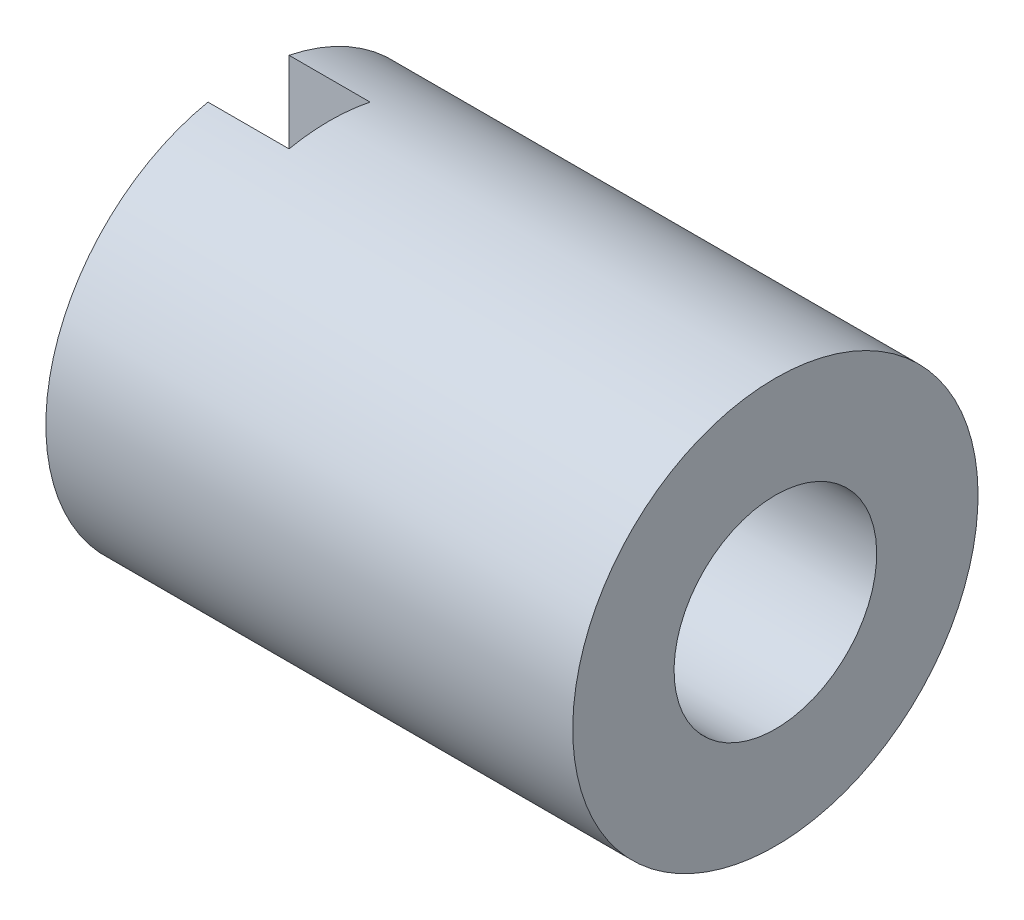
ISO-10303-21;
HEADER;
FILE_DESCRIPTION(('STEP AP214'),'2;1');
FILE_NAME('part.step','',(''),(''),'','','');
FILE_SCHEMA(('AUTOMOTIVE_DESIGN { 1 0 10303 214 1 1 1 1 }'));
ENDSEC;
DATA;
#1=APPLICATION_CONTEXT('core data for automotive mechanical design processes');
#2=APPLICATION_PROTOCOL_DEFINITION('international standard','automotive_design',2000,#1);
#3=PRODUCT_CONTEXT('',#1,'mechanical');
#4=PRODUCT('Part','Part','',(#3));
#5=PRODUCT_RELATED_PRODUCT_CATEGORY('part','',(#4));
#6=PRODUCT_DEFINITION_FORMATION('','',#4);
#7=PRODUCT_DEFINITION_CONTEXT('part definition',#1,'design');
#8=PRODUCT_DEFINITION('design','',#6,#7);
#9=PRODUCT_DEFINITION_SHAPE('','',#8);
#10=(LENGTH_UNIT() NAMED_UNIT(*) SI_UNIT(.MILLI.,.METRE.));
#11=(NAMED_UNIT(*) PLANE_ANGLE_UNIT() SI_UNIT($,.RADIAN.));
#12=(NAMED_UNIT(*) SI_UNIT($,.STERADIAN.) SOLID_ANGLE_UNIT());
#13=UNCERTAINTY_MEASURE_WITH_UNIT(LENGTH_MEASURE(1.E-05),#10,'distance_accuracy_value','');
#14=(GEOMETRIC_REPRESENTATION_CONTEXT(3) GLOBAL_UNCERTAINTY_ASSIGNED_CONTEXT((#13)) GLOBAL_UNIT_ASSIGNED_CONTEXT((#10,
#11,#12)) REPRESENTATION_CONTEXT('',''));
#15=CARTESIAN_POINT('',(0.,0.,0.));
#16=DIRECTION('',(0.,0.,1.));
#17=DIRECTION('',(1.,0.,0.));
#18=AXIS2_PLACEMENT_3D('',#15,#16,#17);
#19=CARTESIAN_POINT('',(0.,0.,0.));
#20=DIRECTION('',(-1.,0.,0.));
#21=DIRECTION('',(0.,-1.,0.));
#22=AXIS2_PLACEMENT_3D('',#19,#20,#21);
#23=PLANE('',#22);
#24=DIRECTION('',(0.,1.,0.));
#25=VECTOR('',#24,1.);
#26=CARTESIAN_POINT('',(0.,-2.5,0.5));
#27=LINE('',#26,#25);
#28=CARTESIAN_POINT('',(0.,-2.44948974278318,0.5));
#29=VERTEX_POINT('',#28);
#30=CARTESIAN_POINT('',(0.,2.44948974278318,0.5));
#31=VERTEX_POINT('',#30);
#32=EDGE_CURVE('E77',#29,#31,#27,.T.);
#33=ORIENTED_EDGE('',*,*,#32,.F.);
#34=CARTESIAN_POINT('',(0.,0.,0.));
#35=DIRECTION('',(1.,0.,0.));
#36=DIRECTION('',(0.,1.,0.));
#37=AXIS2_PLACEMENT_3D('',#34,#35,#36);
#38=CIRCLE('',#37,2.5);
#39=EDGE_CURVE('E82',#31,#29,#38,.T.);
#40=ORIENTED_EDGE('',*,*,#39,.F.);
#41=EDGE_LOOP('',(#33,#40));
#42=FACE_BOUND('',#41,.T.);
#43=ADVANCED_FACE('F36',(#42),#23,.T.);
#44=DIRECTION('',(0.,-1.,0.));
#45=VECTOR('',#44,1.);
#46=CARTESIAN_POINT('',(0.,-2.5,-0.5));
#47=LINE('',#46,#45);
#48=CARTESIAN_POINT('',(0.,2.44948974278318,-0.5));
#49=VERTEX_POINT('',#48);
#50=CARTESIAN_POINT('',(0.,-2.44948974278318,-0.5));
#51=VERTEX_POINT('',#50);
#52=EDGE_CURVE('E83',#49,#51,#47,.T.);
#53=ORIENTED_EDGE('',*,*,#52,.F.);
#54=EDGE_CURVE('E90',#51,#49,#38,.T.);
#55=ORIENTED_EDGE('',*,*,#54,.F.);
#56=EDGE_LOOP('',(#53,#55));
#57=FACE_BOUND('',#56,.T.);
#58=ADVANCED_FACE('F38',(#57),#23,.T.);
#59=CARTESIAN_POINT('',(2.,0.,0.));
#60=DIRECTION('',(1.,0.,0.));
#61=DIRECTION('',(0.,1.,0.));
#62=AXIS2_PLACEMENT_3D('',#59,#60,#61);
#63=CYLINDRICAL_SURFACE('',#62,2.5);
#64=DIRECTION('',(1.,0.,0.));
#65=VECTOR('',#64,1.);
#66=CARTESIAN_POINT('',(2.,-2.44948974278318,0.5));
#67=LINE('',#66,#65);
#68=CARTESIAN_POINT('',(1.,-2.44948974278318,0.5));
#69=VERTEX_POINT('',#68);
#70=EDGE_CURVE('E11',#69,#29,#67,.F.);
#71=ORIENTED_EDGE('',*,*,#70,.F.);
#72=CARTESIAN_POINT('',(1.,0.,0.));
#73=DIRECTION('',(1.,0.,0.));
#74=DIRECTION('',(0.,1.,0.));
#75=AXIS2_PLACEMENT_3D('',#72,#73,#74);
#76=CIRCLE('',#75,2.5);
#77=CARTESIAN_POINT('',(1.,-2.44948974278318,-0.5));
#78=VERTEX_POINT('',#77);
#79=EDGE_CURVE('E58',#78,#69,#76,.F.);
#80=ORIENTED_EDGE('',*,*,#79,.F.);
#81=DIRECTION('',(1.,0.,0.));
#82=VECTOR('',#81,1.);
#83=CARTESIAN_POINT('',(2.,-2.44948974278318,-0.5));
#84=LINE('',#83,#82);
#85=EDGE_CURVE('E44',#51,#78,#84,.T.);
#86=ORIENTED_EDGE('',*,*,#85,.F.);
#87=ORIENTED_EDGE('',*,*,#54,.T.);
#88=DIRECTION('',(1.,0.,0.));
#89=VECTOR('',#88,1.);
#90=CARTESIAN_POINT('',(2.,2.44948974278318,-0.5));
#91=LINE('',#90,#89);
#92=CARTESIAN_POINT('',(1.,2.44948974278318,-0.5));
#93=VERTEX_POINT('',#92);
#94=EDGE_CURVE('E92',#93,#49,#91,.F.);
#95=ORIENTED_EDGE('',*,*,#94,.F.);
#96=CARTESIAN_POINT('',(1.,2.44948974278318,0.5));
#97=VERTEX_POINT('',#96);
#98=EDGE_CURVE('E89',#97,#93,#76,.F.);
#99=ORIENTED_EDGE('',*,*,#98,.F.);
#100=DIRECTION('',(1.,0.,0.));
#101=VECTOR('',#100,1.);
#102=CARTESIAN_POINT('',(2.,2.44948974278318,0.5));
#103=LINE('',#102,#101);
#104=EDGE_CURVE('E88',#31,#97,#103,.T.);
#105=ORIENTED_EDGE('',*,*,#104,.F.);
#106=ORIENTED_EDGE('',*,*,#39,.T.);
#107=EDGE_LOOP('',(#71,#80,#86,#87,#95,#99,#105,#106));
#108=FACE_BOUND('',#107,.T.);
#109=CARTESIAN_POINT('',(6.5,0.,0.));
#110=DIRECTION('',(1.,0.,0.));
#111=DIRECTION('',(0.,1.,0.));
#112=AXIS2_PLACEMENT_3D('',#109,#110,#111);
#113=CIRCLE('',#112,2.5);
#114=CARTESIAN_POINT('',(6.5,2.5,0.));
#115=VERTEX_POINT('',#114);
#116=EDGE_CURVE('E95',#115,#115,#113,.T.);
#117=ORIENTED_EDGE('',*,*,#116,.F.);
#118=EDGE_LOOP('',(#117));
#119=FACE_BOUND('',#118,.T.);
#120=ADVANCED_FACE('F85',(#108,#119),#63,.T.);
#121=CARTESIAN_POINT('',(6.5,2.5,0.));
#122=DIRECTION('',(1.,0.,0.));
#123=DIRECTION('',(0.,1.,0.));
#124=AXIS2_PLACEMENT_3D('',#121,#122,#123);
#125=PLANE('',#124);
#126=ORIENTED_EDGE('',*,*,#116,.T.);
#127=EDGE_LOOP('',(#126));
#128=FACE_BOUND('',#127,.T.);
#129=CARTESIAN_POINT('',(6.5,0.,0.));
#130=DIRECTION('',(1.,0.,0.));
#131=DIRECTION('',(0.,1.,0.));
#132=AXIS2_PLACEMENT_3D('',#129,#130,#131);
#133=CIRCLE('',#132,1.25);
#134=CARTESIAN_POINT('',(6.5,1.25,0.));
#135=VERTEX_POINT('',#134);
#136=EDGE_CURVE('E109',#135,#135,#133,.T.);
#137=ORIENTED_EDGE('',*,*,#136,.F.);
#138=EDGE_LOOP('',(#137));
#139=FACE_BOUND('',#138,.T.);
#140=ADVANCED_FACE('F119',(#128,#139),#125,.T.);
#141=CARTESIAN_POINT('',(2.,0.,0.));
#142=DIRECTION('',(1.,0.,0.));
#143=DIRECTION('',(0.,1.,0.));
#144=AXIS2_PLACEMENT_3D('',#141,#142,#143);
#145=CYLINDRICAL_SURFACE('',#144,1.25);
#146=ORIENTED_EDGE('',*,*,#136,.T.);
#147=EDGE_LOOP('',(#146));
#148=FACE_BOUND('',#147,.T.);
#149=CARTESIAN_POINT('',(2.,0.,0.));
#150=DIRECTION('',(1.,0.,0.));
#151=DIRECTION('',(0.,1.,0.));
#152=AXIS2_PLACEMENT_3D('',#149,#150,#151);
#153=CIRCLE('',#152,1.25);
#154=CARTESIAN_POINT('',(2.,1.25,0.));
#155=VERTEX_POINT('',#154);
#156=EDGE_CURVE('E106',#155,#155,#153,.T.);
#157=ORIENTED_EDGE('',*,*,#156,.F.);
#158=EDGE_LOOP('',(#157));
#159=FACE_BOUND('',#158,.T.);
#160=ADVANCED_FACE('F126',(#148,#159),#145,.F.);
#161=CARTESIAN_POINT('',(2.,1.25,0.));
#162=DIRECTION('',(1.,0.,0.));
#163=DIRECTION('',(0.,1.,0.));
#164=AXIS2_PLACEMENT_3D('',#161,#162,#163);
#165=PLANE('',#164);
#166=ORIENTED_EDGE('',*,*,#156,.T.);
#167=EDGE_LOOP('',(#166));
#168=FACE_BOUND('',#167,.T.);
#169=ADVANCED_FACE('F152',(#168),#165,.T.);
#170=CARTESIAN_POINT('',(1.,-2.5,0.5));
#171=DIRECTION('',(0.,0.,1.));
#172=DIRECTION('',(1.,0.,0.));
#173=AXIS2_PLACEMENT_3D('',#170,#171,#172);
#174=PLANE('',#173);
#175=ORIENTED_EDGE('',*,*,#70,.T.);
#176=ORIENTED_EDGE('',*,*,#32,.T.);
#177=ORIENTED_EDGE('',*,*,#104,.T.);
#178=DIRECTION('',(0.,1.,0.));
#179=VECTOR('',#178,1.);
#180=CARTESIAN_POINT('',(1.,-2.5,0.5));
#181=LINE('',#180,#179);
#182=EDGE_CURVE('E51',#69,#97,#181,.T.);
#183=ORIENTED_EDGE('',*,*,#182,.F.);
#184=EDGE_LOOP('',(#175,#176,#177,#183));
#185=FACE_BOUND('',#184,.T.);
#186=ADVANCED_FACE('F76',(#185),#174,.F.);
#187=CARTESIAN_POINT('',(1.,-2.5,-0.5));
#188=DIRECTION('',(0.,0.,-1.));
#189=DIRECTION('',(-1.,0.,0.));
#190=AXIS2_PLACEMENT_3D('',#187,#188,#189);
#191=PLANE('',#190);
#192=ORIENTED_EDGE('',*,*,#94,.T.);
#193=ORIENTED_EDGE('',*,*,#52,.T.);
#194=ORIENTED_EDGE('',*,*,#85,.T.);
#195=DIRECTION('',(0.,-1.,0.));
#196=VECTOR('',#195,1.);
#197=CARTESIAN_POINT('',(1.,-2.5,-0.5));
#198=LINE('',#197,#196);
#199=EDGE_CURVE('E104',#93,#78,#198,.T.);
#200=ORIENTED_EDGE('',*,*,#199,.F.);
#201=EDGE_LOOP('',(#192,#193,#194,#200));
#202=FACE_BOUND('',#201,.T.);
#203=ADVANCED_FACE('F151',(#202),#191,.F.);
#204=CARTESIAN_POINT('',(1.,0.,0.));
#205=DIRECTION('',(1.,0.,0.));
#206=DIRECTION('',(0.,1.,0.));
#207=AXIS2_PLACEMENT_3D('',#204,#205,#206);
#208=PLANE('',#207);
#209=ORIENTED_EDGE('',*,*,#199,.T.);
#210=ORIENTED_EDGE('',*,*,#79,.T.);
#211=ORIENTED_EDGE('',*,*,#182,.T.);
#212=ORIENTED_EDGE('',*,*,#98,.T.);
#213=EDGE_LOOP('',(#209,#210,#211,#212));
#214=FACE_BOUND('',#213,.T.);
#215=ADVANCED_FACE('F103',(#214),#208,.F.);
#216=CLOSED_SHELL('',(#43,#58,#120,#140,#160,#169,#186,#203,#215));
#217=MANIFOLD_SOLID_BREP('B2',#216);
#218=ADVANCED_BREP_SHAPE_REPRESENTATION('',(#18,#217),#14);
#219=SHAPE_DEFINITION_REPRESENTATION(#9,#218);
ENDSEC;
END-ISO-10303-21;
